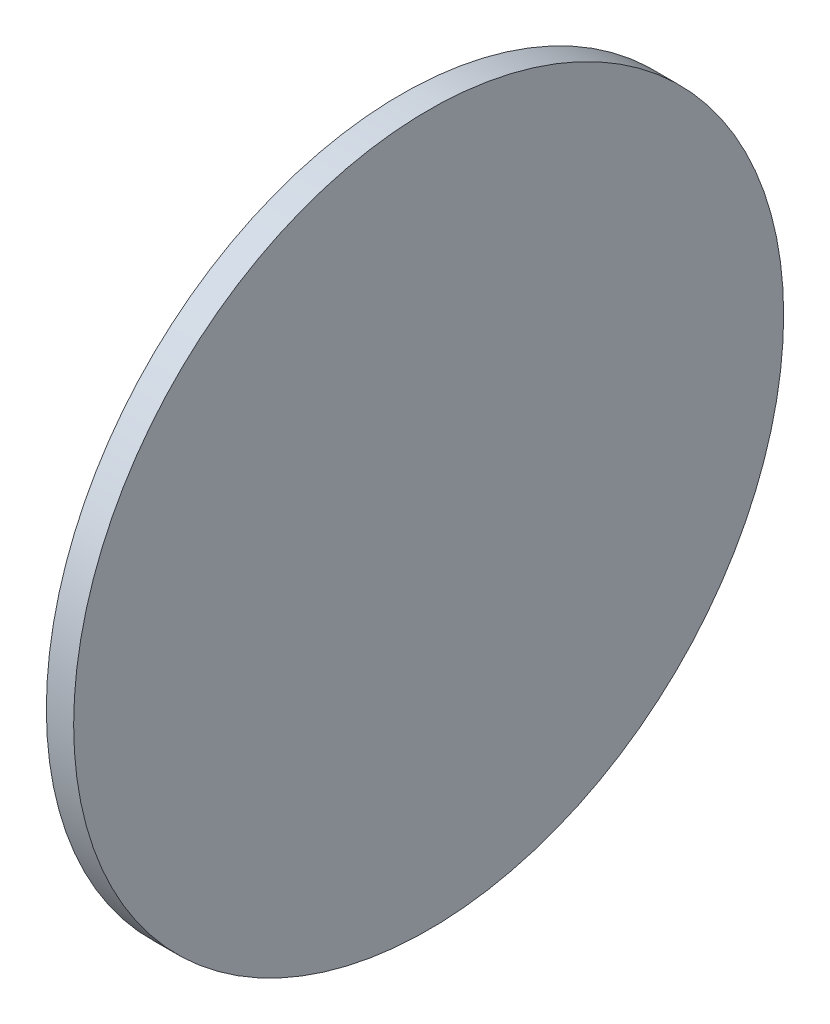
ISO-10303-21;
HEADER;
FILE_DESCRIPTION(('STEP AP214'),'2;1');
FILE_NAME('part.step','',(''),(''),'','','');
FILE_SCHEMA(('AUTOMOTIVE_DESIGN { 1 0 10303 214 1 1 1 1 }'));
ENDSEC;
DATA;
#1=APPLICATION_CONTEXT('core data for automotive mechanical design processes');
#2=APPLICATION_PROTOCOL_DEFINITION('international standard','automotive_design',2000,#1);
#3=PRODUCT_CONTEXT('',#1,'mechanical');
#4=PRODUCT('Part','Part','',(#3));
#5=PRODUCT_RELATED_PRODUCT_CATEGORY('part','',(#4));
#6=PRODUCT_DEFINITION_FORMATION('','',#4);
#7=PRODUCT_DEFINITION_CONTEXT('part definition',#1,'design');
#8=PRODUCT_DEFINITION('design','',#6,#7);
#9=PRODUCT_DEFINITION_SHAPE('','',#8);
#10=(LENGTH_UNIT() NAMED_UNIT(*) SI_UNIT(.MILLI.,.METRE.));
#11=(NAMED_UNIT(*) PLANE_ANGLE_UNIT() SI_UNIT($,.RADIAN.));
#12=(NAMED_UNIT(*) SI_UNIT($,.STERADIAN.) SOLID_ANGLE_UNIT());
#13=UNCERTAINTY_MEASURE_WITH_UNIT(LENGTH_MEASURE(1.E-05),#10,'distance_accuracy_value','');
#14=(GEOMETRIC_REPRESENTATION_CONTEXT(3) GLOBAL_UNCERTAINTY_ASSIGNED_CONTEXT((#13)) GLOBAL_UNIT_ASSIGNED_CONTEXT((#10,
#11,#12)) REPRESENTATION_CONTEXT('',''));
#15=CARTESIAN_POINT('',(0.,0.,0.));
#16=DIRECTION('',(0.,0.,1.));
#17=DIRECTION('',(1.,0.,0.));
#18=AXIS2_PLACEMENT_3D('',#15,#16,#17);
#19=CARTESIAN_POINT('',(25.4,0.,0.));
#20=DIRECTION('',(-1.,0.,0.));
#21=DIRECTION('',(0.,0.,1.));
#22=AXIS2_PLACEMENT_3D('',#19,#20,#21);
#23=CYLINDRICAL_SURFACE('',#22,330.2);
#24=CARTESIAN_POINT('',(25.4,0.,0.));
#25=DIRECTION('',(1.,0.,0.));
#26=DIRECTION('',(0.,0.,-1.));
#27=AXIS2_PLACEMENT_3D('',#24,#25,#26);
#28=CIRCLE('',#27,330.2);
#29=CARTESIAN_POINT('',(25.4,0.,-330.2));
#30=VERTEX_POINT('',#29);
#31=EDGE_CURVE('E10',#30,#30,#28,.T.);
#32=ORIENTED_EDGE('',*,*,#31,.F.);
#33=EDGE_LOOP('',(#32));
#34=FACE_BOUND('',#33,.T.);
#35=CARTESIAN_POINT('',(0.,0.,0.));
#36=DIRECTION('',(1.,0.,0.));
#37=DIRECTION('',(0.,0.,-1.));
#38=AXIS2_PLACEMENT_3D('',#35,#36,#37);
#39=CIRCLE('',#38,330.2);
#40=CARTESIAN_POINT('',(0.,0.,-330.2));
#41=VERTEX_POINT('',#40);
#42=EDGE_CURVE('E46',#41,#41,#39,.T.);
#43=ORIENTED_EDGE('',*,*,#42,.T.);
#44=EDGE_LOOP('',(#43));
#45=FACE_BOUND('',#44,.T.);
#46=ADVANCED_FACE('F43',(#34,#45),#23,.T.);
#47=CARTESIAN_POINT('',(25.4,0.,0.));
#48=DIRECTION('',(1.,0.,0.));
#49=DIRECTION('',(0.,0.,-1.));
#50=AXIS2_PLACEMENT_3D('',#47,#48,#49);
#51=PLANE('',#50);
#52=ORIENTED_EDGE('',*,*,#31,.T.);
#53=EDGE_LOOP('',(#52));
#54=FACE_BOUND('',#53,.T.);
#55=ADVANCED_FACE('F60',(#54),#51,.T.);
#56=CARTESIAN_POINT('',(0.,0.,0.));
#57=DIRECTION('',(1.,0.,0.));
#58=DIRECTION('',(0.,0.,-1.));
#59=AXIS2_PLACEMENT_3D('',#56,#57,#58);
#60=PLANE('',#59);
#61=ORIENTED_EDGE('',*,*,#42,.F.);
#62=EDGE_LOOP('',(#61));
#63=FACE_BOUND('',#62,.T.);
#64=ADVANCED_FACE('F58',(#63),#60,.F.);
#65=CLOSED_SHELL('',(#46,#55,#64));
#66=MANIFOLD_SOLID_BREP('B2',#65);
#67=ADVANCED_BREP_SHAPE_REPRESENTATION('',(#18,#66),#14);
#68=SHAPE_DEFINITION_REPRESENTATION(#9,#67);
ENDSEC;
END-ISO-10303-21;
